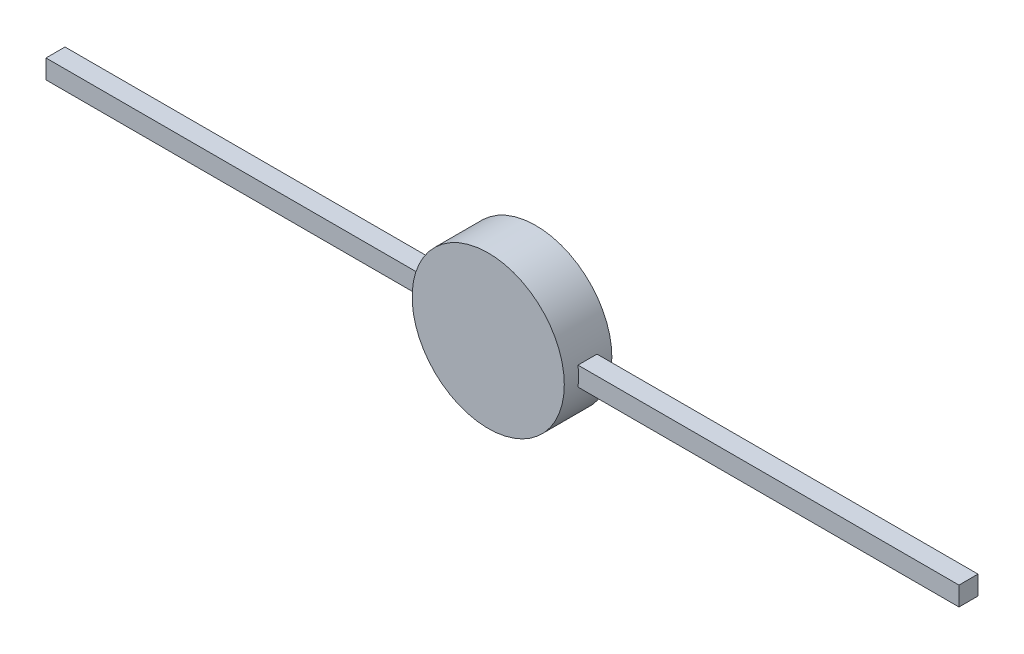
ISO-10303-21;
HEADER;
FILE_DESCRIPTION(('STEP AP214'),'2;1');
FILE_NAME('part.step','',(''),(''),'','','');
FILE_SCHEMA(('AUTOMOTIVE_DESIGN { 1 0 10303 214 1 1 1 1 }'));
ENDSEC;
DATA;
#1=APPLICATION_CONTEXT('core data for automotive mechanical design processes');
#2=APPLICATION_PROTOCOL_DEFINITION('international standard','automotive_design',2000,#1);
#3=PRODUCT_CONTEXT('',#1,'mechanical');
#4=PRODUCT('Part','Part','',(#3));
#5=PRODUCT_RELATED_PRODUCT_CATEGORY('part','',(#4));
#6=PRODUCT_DEFINITION_FORMATION('','',#4);
#7=PRODUCT_DEFINITION_CONTEXT('part definition',#1,'design');
#8=PRODUCT_DEFINITION('design','',#6,#7);
#9=PRODUCT_DEFINITION_SHAPE('','',#8);
#10=(LENGTH_UNIT() NAMED_UNIT(*) SI_UNIT(.MILLI.,.METRE.));
#11=(NAMED_UNIT(*) PLANE_ANGLE_UNIT() SI_UNIT($,.RADIAN.));
#12=(NAMED_UNIT(*) SI_UNIT($,.STERADIAN.) SOLID_ANGLE_UNIT());
#13=UNCERTAINTY_MEASURE_WITH_UNIT(LENGTH_MEASURE(1.E-05),#10,'distance_accuracy_value','');
#14=(GEOMETRIC_REPRESENTATION_CONTEXT(3) GLOBAL_UNCERTAINTY_ASSIGNED_CONTEXT((#13)) GLOBAL_UNIT_ASSIGNED_CONTEXT((#10,
#11,#12)) REPRESENTATION_CONTEXT('',''));
#15=CARTESIAN_POINT('',(0.,0.,0.));
#16=DIRECTION('',(0.,0.,1.));
#17=DIRECTION('',(1.,0.,0.));
#18=AXIS2_PLACEMENT_3D('',#15,#16,#17);
#19=CARTESIAN_POINT('',(0.,0.,5.));
#20=DIRECTION('',(0.,0.,-1.));
#21=DIRECTION('',(-1.,0.,0.));
#22=AXIS2_PLACEMENT_3D('',#19,#20,#21);
#23=CYLINDRICAL_SURFACE('',#22,8.);
#24=CARTESIAN_POINT('',(0.,0.,0.));
#25=DIRECTION('',(0.,0.,1.));
#26=DIRECTION('',(1.,0.,0.));
#27=AXIS2_PLACEMENT_3D('',#24,#25,#26);
#28=CIRCLE('',#27,8.);
#29=CARTESIAN_POINT('',(8.,0.,0.));
#30=VERTEX_POINT('',#29);
#31=EDGE_CURVE('E159',#30,#30,#28,.T.);
#32=ORIENTED_EDGE('',*,*,#31,.T.);
#33=EDGE_LOOP('',(#32));
#34=FACE_BOUND('',#33,.T.);
#35=CARTESIAN_POINT('',(0.,0.,5.));
#36=DIRECTION('',(0.,0.,1.));
#37=DIRECTION('',(1.,0.,0.));
#38=AXIS2_PLACEMENT_3D('',#35,#36,#37);
#39=CIRCLE('',#38,8.);
#40=CARTESIAN_POINT('',(8.,0.,5.));
#41=VERTEX_POINT('',#40);
#42=EDGE_CURVE('E168',#41,#41,#39,.T.);
#43=ORIENTED_EDGE('',*,*,#42,.F.);
#44=EDGE_LOOP('',(#43));
#45=FACE_BOUND('',#44,.T.);
#46=DIRECTION('',(0.,0.,-1.));
#47=VECTOR('',#46,1.);
#48=CARTESIAN_POINT('',(-7.93725393319377,1.,5.));
#49=LINE('',#48,#47);
#50=CARTESIAN_POINT('',(-7.93725393319377,1.,1.50000000000011));
#51=VERTEX_POINT('',#50);
#52=CARTESIAN_POINT('',(-7.93725393319377,1.,3.50000000000017));
#53=VERTEX_POINT('',#52);
#54=EDGE_CURVE('E172',#51,#53,#49,.F.);
#55=ORIENTED_EDGE('',*,*,#54,.T.);
#56=CARTESIAN_POINT('',(0.,0.,3.50000000000017));
#57=DIRECTION('',(0.,0.,1.));
#58=DIRECTION('',(1.,0.,0.));
#59=AXIS2_PLACEMENT_3D('',#56,#57,#58);
#60=CIRCLE('',#59,8.);
#61=CARTESIAN_POINT('',(-7.93725393319377,-1.,3.50000000000011));
#62=VERTEX_POINT('',#61);
#63=EDGE_CURVE('E187',#53,#62,#60,.T.);
#64=ORIENTED_EDGE('',*,*,#63,.T.);
#65=DIRECTION('',(0.,0.,-1.));
#66=VECTOR('',#65,1.);
#67=CARTESIAN_POINT('',(-7.93725393319377,-1.,5.));
#68=LINE('',#67,#66);
#69=CARTESIAN_POINT('',(-7.93725393319377,-1.,1.50000000000011));
#70=VERTEX_POINT('',#69);
#71=EDGE_CURVE('E183',#62,#70,#68,.T.);
#72=ORIENTED_EDGE('',*,*,#71,.T.);
#73=CARTESIAN_POINT('',(0.,0.,1.50000000000017));
#74=DIRECTION('',(0.,0.,-1.));
#75=DIRECTION('',(-1.,0.,0.));
#76=AXIS2_PLACEMENT_3D('',#73,#74,#75);
#77=CIRCLE('',#76,8.);
#78=EDGE_CURVE('E179',#70,#51,#77,.T.);
#79=ORIENTED_EDGE('',*,*,#78,.T.);
#80=EDGE_LOOP('',(#55,#64,#72,#79));
#81=FACE_BOUND('',#80,.T.);
#82=CARTESIAN_POINT('',(0.,0.,3.50000000000017));
#83=DIRECTION('',(0.,0.,-1.));
#84=DIRECTION('',(-1.,0.,0.));
#85=AXIS2_PLACEMENT_3D('',#82,#83,#84);
#86=CIRCLE('',#85,8.);
#87=CARTESIAN_POINT('',(7.93725393319377,1.,3.50000000000017));
#88=VERTEX_POINT('',#87);
#89=CARTESIAN_POINT('',(7.93725393319377,-1.,3.50000000000017));
#90=VERTEX_POINT('',#89);
#91=EDGE_CURVE('E11',#88,#90,#86,.T.);
#92=ORIENTED_EDGE('',*,*,#91,.F.);
#93=DIRECTION('',(0.,0.,-1.));
#94=VECTOR('',#93,1.);
#95=CARTESIAN_POINT('',(7.93725393319377,1.,5.));
#96=LINE('',#95,#94);
#97=CARTESIAN_POINT('',(7.93725393319377,1.,1.50000000000011));
#98=VERTEX_POINT('',#97);
#99=EDGE_CURVE('E47',#98,#88,#96,.F.);
#100=ORIENTED_EDGE('',*,*,#99,.F.);
#101=CARTESIAN_POINT('',(0.,0.,1.50000000000017));
#102=DIRECTION('',(0.,0.,1.));
#103=DIRECTION('',(1.,0.,0.));
#104=AXIS2_PLACEMENT_3D('',#101,#102,#103);
#105=CIRCLE('',#104,8.);
#106=CARTESIAN_POINT('',(7.93725393319377,-1.,1.50000000000011));
#107=VERTEX_POINT('',#106);
#108=EDGE_CURVE('E194',#107,#98,#105,.T.);
#109=ORIENTED_EDGE('',*,*,#108,.F.);
#110=DIRECTION('',(0.,0.,-1.));
#111=VECTOR('',#110,1.);
#112=CARTESIAN_POINT('',(7.93725393319377,-1.,5.));
#113=LINE('',#112,#111);
#114=EDGE_CURVE('E191',#90,#107,#113,.T.);
#115=ORIENTED_EDGE('',*,*,#114,.F.);
#116=EDGE_LOOP('',(#92,#100,#109,#115));
#117=FACE_BOUND('',#116,.T.);
#118=ADVANCED_FACE('F39',(#34,#45,#81,#117),#23,.T.);
#119=CARTESIAN_POINT('',(0.,0.,5.));
#120=DIRECTION('',(0.,0.,1.));
#121=DIRECTION('',(1.,0.,0.));
#122=AXIS2_PLACEMENT_3D('',#119,#120,#121);
#123=PLANE('',#122);
#124=ORIENTED_EDGE('',*,*,#42,.T.);
#125=EDGE_LOOP('',(#124));
#126=FACE_BOUND('',#125,.T.);
#127=ADVANCED_FACE('F203',(#126),#123,.T.);
#128=CARTESIAN_POINT('',(0.,0.,0.));
#129=DIRECTION('',(0.,0.,1.));
#130=DIRECTION('',(1.,0.,0.));
#131=AXIS2_PLACEMENT_3D('',#128,#129,#130);
#132=PLANE('',#131);
#133=ORIENTED_EDGE('',*,*,#31,.F.);
#134=EDGE_LOOP('',(#133));
#135=FACE_BOUND('',#134,.T.);
#136=ADVANCED_FACE('F208',(#135),#132,.F.);
#137=CARTESIAN_POINT('',(0.,-1.,1.50000000000017));
#138=DIRECTION('',(0.,-1.,0.));
#139=DIRECTION('',(0.,0.,-1.));
#140=AXIS2_PLACEMENT_3D('',#137,#138,#139);
#141=PLANE('',#140);
#142=ORIENTED_EDGE('',*,*,#71,.F.);
#143=DIRECTION('',(-1.,0.,0.));
#144=VECTOR('',#143,1.);
#145=CARTESIAN_POINT('',(0.,-1.,3.50000000000017));
#146=LINE('',#145,#144);
#147=CARTESIAN_POINT('',(-48.,-1.,3.49999999999983));
#148=VERTEX_POINT('',#147);
#149=EDGE_CURVE('E156',#62,#148,#146,.T.);
#150=ORIENTED_EDGE('',*,*,#149,.T.);
#151=DIRECTION('',(0.,0.,1.));
#152=VECTOR('',#151,1.);
#153=CARTESIAN_POINT('',(-48.,-1.,1.49999999999983));
#154=LINE('',#153,#152);
#155=CARTESIAN_POINT('',(-48.,-1.,1.49999999999983));
#156=VERTEX_POINT('',#155);
#157=EDGE_CURVE('E151',#156,#148,#154,.T.);
#158=ORIENTED_EDGE('',*,*,#157,.F.);
#159=DIRECTION('',(-1.,0.,0.));
#160=VECTOR('',#159,1.);
#161=CARTESIAN_POINT('',(0.,-1.,1.50000000000017));
#162=LINE('',#161,#160);
#163=EDGE_CURVE('E160',#70,#156,#162,.T.);
#164=ORIENTED_EDGE('',*,*,#163,.F.);
#165=EDGE_LOOP('',(#142,#150,#158,#164));
#166=FACE_BOUND('',#165,.T.);
#167=ADVANCED_FACE('F232',(#166),#141,.T.);
#168=CARTESIAN_POINT('',(0.,1.,1.50000000000017));
#169=DIRECTION('',(0.,1.,0.));
#170=DIRECTION('',(0.,0.,1.));
#171=AXIS2_PLACEMENT_3D('',#168,#169,#170);
#172=PLANE('',#171);
#173=ORIENTED_EDGE('',*,*,#54,.F.);
#174=DIRECTION('',(-1.,0.,0.));
#175=VECTOR('',#174,1.);
#176=CARTESIAN_POINT('',(0.,1.,1.50000000000017));
#177=LINE('',#176,#175);
#178=CARTESIAN_POINT('',(-48.,1.,1.49999999999983));
#179=VERTEX_POINT('',#178);
#180=EDGE_CURVE('E163',#51,#179,#177,.T.);
#181=ORIENTED_EDGE('',*,*,#180,.T.);
#182=DIRECTION('',(0.,0.,-1.));
#183=VECTOR('',#182,1.);
#184=CARTESIAN_POINT('',(-48.,1.,1.49999999999983));
#185=LINE('',#184,#183);
#186=CARTESIAN_POINT('',(-48.,1.,3.49999999999983));
#187=VERTEX_POINT('',#186);
#188=EDGE_CURVE('E143',#187,#179,#185,.T.);
#189=ORIENTED_EDGE('',*,*,#188,.F.);
#190=DIRECTION('',(-1.,0.,0.));
#191=VECTOR('',#190,1.);
#192=CARTESIAN_POINT('',(0.,1.,3.50000000000017));
#193=LINE('',#192,#191);
#194=EDGE_CURVE('E155',#53,#187,#193,.T.);
#195=ORIENTED_EDGE('',*,*,#194,.F.);
#196=EDGE_LOOP('',(#173,#181,#189,#195));
#197=FACE_BOUND('',#196,.T.);
#198=ADVANCED_FACE('F218',(#197),#172,.T.);
#199=CARTESIAN_POINT('',(0.,-1.,3.50000000000017));
#200=DIRECTION('',(0.,0.,1.));
#201=DIRECTION('',(1.,0.,0.));
#202=AXIS2_PLACEMENT_3D('',#199,#200,#201);
#203=PLANE('',#202);
#204=ORIENTED_EDGE('',*,*,#63,.F.);
#205=ORIENTED_EDGE('',*,*,#194,.T.);
#206=DIRECTION('',(0.,1.,0.));
#207=VECTOR('',#206,1.);
#208=CARTESIAN_POINT('',(-48.,-1.,3.49999999999983));
#209=LINE('',#208,#207);
#210=EDGE_CURVE('E134',#148,#187,#209,.T.);
#211=ORIENTED_EDGE('',*,*,#210,.F.);
#212=ORIENTED_EDGE('',*,*,#149,.F.);
#213=EDGE_LOOP('',(#204,#205,#211,#212));
#214=FACE_BOUND('',#213,.T.);
#215=ADVANCED_FACE('F230',(#214),#203,.T.);
#216=CARTESIAN_POINT('',(0.,-1.,1.50000000000017));
#217=DIRECTION('',(0.,0.,-1.));
#218=DIRECTION('',(-1.,0.,0.));
#219=AXIS2_PLACEMENT_3D('',#216,#217,#218);
#220=PLANE('',#219);
#221=ORIENTED_EDGE('',*,*,#78,.F.);
#222=ORIENTED_EDGE('',*,*,#163,.T.);
#223=DIRECTION('',(0.,-1.,0.));
#224=VECTOR('',#223,1.);
#225=CARTESIAN_POINT('',(-48.,-1.,1.49999999999983));
#226=LINE('',#225,#224);
#227=EDGE_CURVE('E147',#179,#156,#226,.T.);
#228=ORIENTED_EDGE('',*,*,#227,.F.);
#229=ORIENTED_EDGE('',*,*,#180,.F.);
#230=EDGE_LOOP('',(#221,#222,#228,#229));
#231=FACE_BOUND('',#230,.T.);
#232=ADVANCED_FACE('F222',(#231),#220,.T.);
#233=CARTESIAN_POINT('',(-48.,0.,-3.33066907387547E-13));
#234=DIRECTION('',(1.,0.,0.));
#235=DIRECTION('',(0.,0.,-1.));
#236=AXIS2_PLACEMENT_3D('',#233,#234,#235);
#237=PLANE('',#236);
#238=ORIENTED_EDGE('',*,*,#210,.T.);
#239=ORIENTED_EDGE('',*,*,#188,.T.);
#240=ORIENTED_EDGE('',*,*,#227,.T.);
#241=ORIENTED_EDGE('',*,*,#157,.T.);
#242=EDGE_LOOP('',(#238,#239,#240,#241));
#243=FACE_BOUND('',#242,.T.);
#244=ADVANCED_FACE('F226',(#243),#237,.F.);
#245=CARTESIAN_POINT('',(0.,1.,1.50000000000017));
#246=DIRECTION('',(0.,-1.,0.));
#247=DIRECTION('',(0.,0.,-1.));
#248=AXIS2_PLACEMENT_3D('',#245,#246,#247);
#249=PLANE('',#248);
#250=DIRECTION('',(1.,0.,0.));
#251=VECTOR('',#250,1.);
#252=CARTESIAN_POINT('',(0.,1.,1.50000000000017));
#253=LINE('',#252,#251);
#254=CARTESIAN_POINT('',(48.,1.,1.49999999999983));
#255=VERTEX_POINT('',#254);
#256=EDGE_CURVE('E135',#98,#255,#253,.T.);
#257=ORIENTED_EDGE('',*,*,#256,.F.);
#258=ORIENTED_EDGE('',*,*,#99,.T.);
#259=DIRECTION('',(1.,0.,0.));
#260=VECTOR('',#259,1.);
#261=CARTESIAN_POINT('',(0.,1.,3.50000000000017));
#262=LINE('',#261,#260);
#263=CARTESIAN_POINT('',(48.,1.,3.49999999999983));
#264=VERTEX_POINT('',#263);
#265=EDGE_CURVE('E131',#88,#264,#262,.T.);
#266=ORIENTED_EDGE('',*,*,#265,.T.);
#267=DIRECTION('',(0.,0.,-1.));
#268=VECTOR('',#267,1.);
#269=CARTESIAN_POINT('',(48.,1.,1.49999999999983));
#270=LINE('',#269,#268);
#271=EDGE_CURVE('E109',#264,#255,#270,.T.);
#272=ORIENTED_EDGE('',*,*,#271,.T.);
#273=EDGE_LOOP('',(#257,#258,#266,#272));
#274=FACE_BOUND('',#273,.T.);
#275=ADVANCED_FACE('F199',(#274),#249,.F.);
#276=CARTESIAN_POINT('',(0.,-1.,1.50000000000017));
#277=DIRECTION('',(0.,1.,0.));
#278=DIRECTION('',(0.,0.,1.));
#279=AXIS2_PLACEMENT_3D('',#276,#277,#278);
#280=PLANE('',#279);
#281=DIRECTION('',(1.,0.,0.));
#282=VECTOR('',#281,1.);
#283=CARTESIAN_POINT('',(0.,-1.,3.50000000000017));
#284=LINE('',#283,#282);
#285=CARTESIAN_POINT('',(48.,-1.,3.49999999999983));
#286=VERTEX_POINT('',#285);
#287=EDGE_CURVE('E99',#90,#286,#284,.T.);
#288=ORIENTED_EDGE('',*,*,#287,.F.);
#289=ORIENTED_EDGE('',*,*,#114,.T.);
#290=DIRECTION('',(1.,0.,0.));
#291=VECTOR('',#290,1.);
#292=CARTESIAN_POINT('',(0.,-1.,1.50000000000017));
#293=LINE('',#292,#291);
#294=CARTESIAN_POINT('',(48.,-1.,1.49999999999983));
#295=VERTEX_POINT('',#294);
#296=EDGE_CURVE('E108',#107,#295,#293,.T.);
#297=ORIENTED_EDGE('',*,*,#296,.T.);
#298=DIRECTION('',(0.,0.,1.));
#299=VECTOR('',#298,1.);
#300=CARTESIAN_POINT('',(48.,-1.,1.49999999999983));
#301=LINE('',#300,#299);
#302=EDGE_CURVE('E112',#295,#286,#301,.T.);
#303=ORIENTED_EDGE('',*,*,#302,.T.);
#304=EDGE_LOOP('',(#288,#289,#297,#303));
#305=FACE_BOUND('',#304,.T.);
#306=ADVANCED_FACE('F113',(#305),#280,.F.);
#307=CARTESIAN_POINT('',(0.,-1.,3.50000000000017));
#308=DIRECTION('',(0.,0.,-1.));
#309=DIRECTION('',(-1.,0.,0.));
#310=AXIS2_PLACEMENT_3D('',#307,#308,#309);
#311=PLANE('',#310);
#312=ORIENTED_EDGE('',*,*,#265,.F.);
#313=ORIENTED_EDGE('',*,*,#91,.T.);
#314=ORIENTED_EDGE('',*,*,#287,.T.);
#315=DIRECTION('',(0.,1.,0.));
#316=VECTOR('',#315,1.);
#317=CARTESIAN_POINT('',(48.,-1.,3.49999999999983));
#318=LINE('',#317,#316);
#319=EDGE_CURVE('E104',#286,#264,#318,.T.);
#320=ORIENTED_EDGE('',*,*,#319,.T.);
#321=EDGE_LOOP('',(#312,#313,#314,#320));
#322=FACE_BOUND('',#321,.T.);
#323=ADVANCED_FACE('F102',(#322),#311,.F.);
#324=CARTESIAN_POINT('',(0.,-1.,1.50000000000017));
#325=DIRECTION('',(0.,0.,1.));
#326=DIRECTION('',(1.,0.,0.));
#327=AXIS2_PLACEMENT_3D('',#324,#325,#326);
#328=PLANE('',#327);
#329=ORIENTED_EDGE('',*,*,#296,.F.);
#330=ORIENTED_EDGE('',*,*,#108,.T.);
#331=ORIENTED_EDGE('',*,*,#256,.T.);
#332=DIRECTION('',(0.,-1.,0.));
#333=VECTOR('',#332,1.);
#334=CARTESIAN_POINT('',(48.,-1.,1.49999999999983));
#335=LINE('',#334,#333);
#336=EDGE_CURVE('E119',#255,#295,#335,.T.);
#337=ORIENTED_EDGE('',*,*,#336,.T.);
#338=EDGE_LOOP('',(#329,#330,#331,#337));
#339=FACE_BOUND('',#338,.T.);
#340=ADVANCED_FACE('F201',(#339),#328,.F.);
#341=CARTESIAN_POINT('',(48.,0.,-3.33066907387547E-13));
#342=DIRECTION('',(-1.,0.,0.));
#343=DIRECTION('',(0.,0.,-1.));
#344=AXIS2_PLACEMENT_3D('',#341,#342,#343);
#345=PLANE('',#344);
#346=ORIENTED_EDGE('',*,*,#319,.F.);
#347=ORIENTED_EDGE('',*,*,#302,.F.);
#348=ORIENTED_EDGE('',*,*,#336,.F.);
#349=ORIENTED_EDGE('',*,*,#271,.F.);
#350=EDGE_LOOP('',(#346,#347,#348,#349));
#351=FACE_BOUND('',#350,.T.);
#352=ADVANCED_FACE('F122',(#351),#345,.F.);
#353=CLOSED_SHELL('',(#118,#127,#136,#167,#198,#215,#232,#244,#275,#306,#323,#340,#352));
#354=MANIFOLD_SOLID_BREP('B2',#353);
#355=ADVANCED_BREP_SHAPE_REPRESENTATION('',(#18,#354),#14);
#356=SHAPE_DEFINITION_REPRESENTATION(#9,#355);
ENDSEC;
END-ISO-10303-21;
